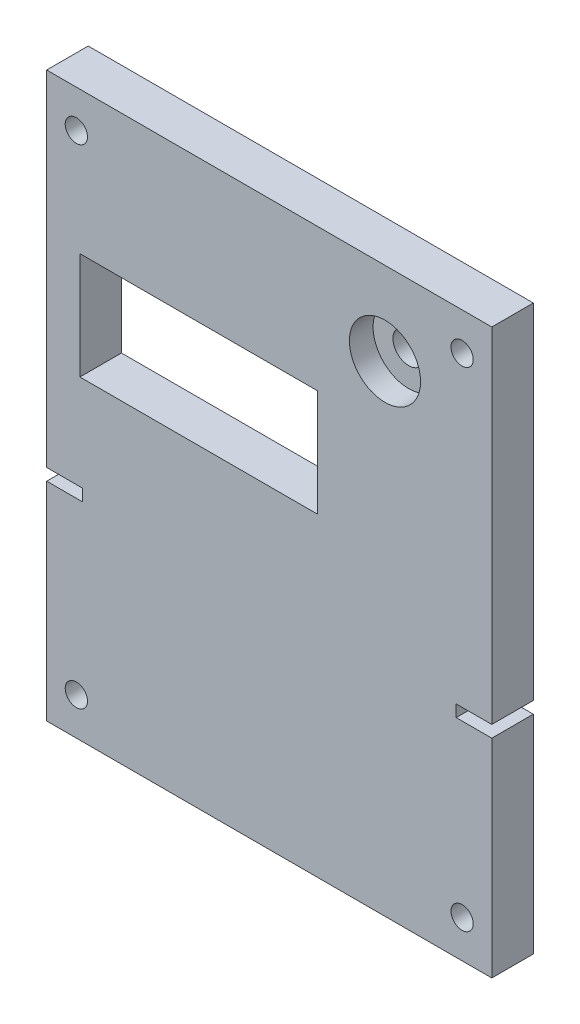
ISO-10303-21;
HEADER;
FILE_DESCRIPTION(('STEP AP214'),'2;1');
FILE_NAME('part.step','',(''),(''),'','','');
FILE_SCHEMA(('AUTOMOTIVE_DESIGN { 1 0 10303 214 1 1 1 1 }'));
ENDSEC;
DATA;
#1=APPLICATION_CONTEXT('core data for automotive mechanical design processes');
#2=APPLICATION_PROTOCOL_DEFINITION('international standard','automotive_design',2000,#1);
#3=PRODUCT_CONTEXT('',#1,'mechanical');
#4=PRODUCT('Part','Part','',(#3));
#5=PRODUCT_RELATED_PRODUCT_CATEGORY('part','',(#4));
#6=PRODUCT_DEFINITION_FORMATION('','',#4);
#7=PRODUCT_DEFINITION_CONTEXT('part definition',#1,'design');
#8=PRODUCT_DEFINITION('design','',#6,#7);
#9=PRODUCT_DEFINITION_SHAPE('','',#8);
#10=(LENGTH_UNIT() NAMED_UNIT(*) SI_UNIT(.MILLI.,.METRE.));
#11=(NAMED_UNIT(*) PLANE_ANGLE_UNIT() SI_UNIT($,.RADIAN.));
#12=(NAMED_UNIT(*) SI_UNIT($,.STERADIAN.) SOLID_ANGLE_UNIT());
#13=UNCERTAINTY_MEASURE_WITH_UNIT(LENGTH_MEASURE(1.E-05),#10,'distance_accuracy_value','');
#14=(GEOMETRIC_REPRESENTATION_CONTEXT(3) GLOBAL_UNCERTAINTY_ASSIGNED_CONTEXT((#13)) GLOBAL_UNIT_ASSIGNED_CONTEXT((#10,
#11,#12)) REPRESENTATION_CONTEXT('',''));
#15=CARTESIAN_POINT('',(0.,0.,0.));
#16=DIRECTION('',(0.,0.,1.));
#17=DIRECTION('',(1.,0.,0.));
#18=AXIS2_PLACEMENT_3D('',#15,#16,#17);
#19=CARTESIAN_POINT('',(47.625,-60.325,8.89));
#20=DIRECTION('',(-1.,0.,0.));
#21=DIRECTION('',(0.,0.,1.));
#22=AXIS2_PLACEMENT_3D('',#19,#20,#21);
#23=PLANE('',#22);
#24=DIRECTION('',(0.,1.,0.));
#25=VECTOR('',#24,1.);
#26=CARTESIAN_POINT('',(47.625,-60.325,0.));
#27=LINE('',#26,#25);
#28=CARTESIAN_POINT('',(47.625,-60.325,0.));
#29=VERTEX_POINT('',#28);
#30=CARTESIAN_POINT('',(47.625,-15.875,0.));
#31=VERTEX_POINT('',#30);
#32=EDGE_CURVE('E188',#29,#31,#27,.T.);
#33=ORIENTED_EDGE('',*,*,#32,.T.);
#34=DIRECTION('',(0.,0.,1.));
#35=VECTOR('',#34,1.);
#36=CARTESIAN_POINT('',(47.625,-15.875,0.));
#37=LINE('',#36,#35);
#38=CARTESIAN_POINT('',(47.625,-15.875,8.89));
#39=VERTEX_POINT('',#38);
#40=EDGE_CURVE('E227',#31,#39,#37,.T.);
#41=ORIENTED_EDGE('',*,*,#40,.T.);
#42=DIRECTION('',(0.,1.,0.));
#43=VECTOR('',#42,1.);
#44=CARTESIAN_POINT('',(47.625,-60.325,8.89));
#45=LINE('',#44,#43);
#46=CARTESIAN_POINT('',(47.625,-60.325,8.89));
#47=VERTEX_POINT('',#46);
#48=EDGE_CURVE('E367',#47,#39,#45,.T.);
#49=ORIENTED_EDGE('',*,*,#48,.F.);
#50=DIRECTION('',(0.,0.,-1.));
#51=VECTOR('',#50,1.);
#52=CARTESIAN_POINT('',(47.625,-60.325,8.89));
#53=LINE('',#52,#51);
#54=EDGE_CURVE('E195',#47,#29,#53,.T.);
#55=ORIENTED_EDGE('',*,*,#54,.T.);
#56=EDGE_LOOP('',(#33,#41,#49,#55));
#57=FACE_BOUND('',#56,.T.);
#58=ADVANCED_FACE('F40',(#57),#23,.F.);
#59=CARTESIAN_POINT('',(-47.625,-60.325,8.89));
#60=DIRECTION('',(1.,0.,0.));
#61=DIRECTION('',(0.,0.,-1.));
#62=AXIS2_PLACEMENT_3D('',#59,#60,#61);
#63=PLANE('',#62);
#64=DIRECTION('',(0.,-1.,0.));
#65=VECTOR('',#64,1.);
#66=CARTESIAN_POINT('',(-47.625,-60.325,0.));
#67=LINE('',#66,#65);
#68=CARTESIAN_POINT('',(-47.625,60.325,0.));
#69=VERTEX_POINT('',#68);
#70=CARTESIAN_POINT('',(-47.625,-13.335,0.));
#71=VERTEX_POINT('',#70);
#72=EDGE_CURVE('E182',#69,#71,#67,.T.);
#73=ORIENTED_EDGE('',*,*,#72,.T.);
#74=DIRECTION('',(0.,0.,1.));
#75=VECTOR('',#74,1.);
#76=CARTESIAN_POINT('',(-47.625,-13.335,0.));
#77=LINE('',#76,#75);
#78=CARTESIAN_POINT('',(-47.625,-13.335,8.89));
#79=VERTEX_POINT('',#78);
#80=EDGE_CURVE('E233',#71,#79,#77,.T.);
#81=ORIENTED_EDGE('',*,*,#80,.T.);
#82=DIRECTION('',(0.,-1.,0.));
#83=VECTOR('',#82,1.);
#84=CARTESIAN_POINT('',(-47.625,-60.325,8.89));
#85=LINE('',#84,#83);
#86=CARTESIAN_POINT('',(-47.625,60.325,8.89));
#87=VERTEX_POINT('',#86);
#88=EDGE_CURVE('E211',#87,#79,#85,.T.);
#89=ORIENTED_EDGE('',*,*,#88,.F.);
#90=DIRECTION('',(0.,0.,-1.));
#91=VECTOR('',#90,1.);
#92=CARTESIAN_POINT('',(-47.625,60.325,8.89));
#93=LINE('',#92,#91);
#94=EDGE_CURVE('E49',#87,#69,#93,.T.);
#95=ORIENTED_EDGE('',*,*,#94,.T.);
#96=EDGE_LOOP('',(#73,#81,#89,#95));
#97=FACE_BOUND('',#96,.T.);
#98=ADVANCED_FACE('F208',(#97),#63,.F.);
#99=CARTESIAN_POINT('',(47.625,-13.335,8.89));
#100=VERTEX_POINT('',#99);
#101=CARTESIAN_POINT('',(47.625,60.325,8.89));
#102=VERTEX_POINT('',#101);
#103=EDGE_CURVE('E194',#100,#102,#45,.T.);
#104=ORIENTED_EDGE('',*,*,#103,.F.);
#105=DIRECTION('',(0.,0.,1.));
#106=VECTOR('',#105,1.);
#107=CARTESIAN_POINT('',(47.625,-13.335,0.));
#108=LINE('',#107,#106);
#109=CARTESIAN_POINT('',(47.625,-13.335,0.));
#110=VERTEX_POINT('',#109);
#111=EDGE_CURVE('E253',#110,#100,#108,.T.);
#112=ORIENTED_EDGE('',*,*,#111,.F.);
#113=CARTESIAN_POINT('',(47.625,60.325,0.));
#114=VERTEX_POINT('',#113);
#115=EDGE_CURVE('E363',#110,#114,#27,.T.);
#116=ORIENTED_EDGE('',*,*,#115,.T.);
#117=DIRECTION('',(0.,0.,-1.));
#118=VECTOR('',#117,1.);
#119=CARTESIAN_POINT('',(47.625,60.325,8.89));
#120=LINE('',#119,#118);
#121=EDGE_CURVE('E12',#102,#114,#120,.T.);
#122=ORIENTED_EDGE('',*,*,#121,.F.);
#123=EDGE_LOOP('',(#104,#112,#116,#122));
#124=FACE_BOUND('',#123,.T.);
#125=ADVANCED_FACE('F42',(#124),#23,.F.);
#126=CARTESIAN_POINT('',(-47.625,60.325,8.89));
#127=DIRECTION('',(0.,-1.,0.));
#128=DIRECTION('',(0.,0.,-1.));
#129=AXIS2_PLACEMENT_3D('',#126,#127,#128);
#130=PLANE('',#129);
#131=DIRECTION('',(-1.,0.,0.));
#132=VECTOR('',#131,1.);
#133=CARTESIAN_POINT('',(-47.625,60.325,0.));
#134=LINE('',#133,#132);
#135=EDGE_CURVE('E183',#114,#69,#134,.T.);
#136=ORIENTED_EDGE('',*,*,#135,.T.);
#137=ORIENTED_EDGE('',*,*,#94,.F.);
#138=DIRECTION('',(-1.,0.,0.));
#139=VECTOR('',#138,1.);
#140=CARTESIAN_POINT('',(-47.625,60.325,8.89));
#141=LINE('',#140,#139);
#142=EDGE_CURVE('E371',#102,#87,#141,.T.);
#143=ORIENTED_EDGE('',*,*,#142,.F.);
#144=ORIENTED_EDGE('',*,*,#121,.T.);
#145=EDGE_LOOP('',(#136,#137,#143,#144));
#146=FACE_BOUND('',#145,.T.);
#147=ADVANCED_FACE('F404',(#146),#130,.F.);
#148=CARTESIAN_POINT('',(-47.625,-15.875,8.89));
#149=VERTEX_POINT('',#148);
#150=CARTESIAN_POINT('',(-47.625,-60.325,8.89));
#151=VERTEX_POINT('',#150);
#152=EDGE_CURVE('E171',#149,#151,#85,.T.);
#153=ORIENTED_EDGE('',*,*,#152,.F.);
#154=DIRECTION('',(0.,0.,1.));
#155=VECTOR('',#154,1.);
#156=CARTESIAN_POINT('',(-47.625,-15.875,0.));
#157=LINE('',#156,#155);
#158=CARTESIAN_POINT('',(-47.625,-15.875,0.));
#159=VERTEX_POINT('',#158);
#160=EDGE_CURVE('E157',#159,#149,#157,.T.);
#161=ORIENTED_EDGE('',*,*,#160,.F.);
#162=CARTESIAN_POINT('',(-47.625,-60.325,0.));
#163=VERTEX_POINT('',#162);
#164=EDGE_CURVE('E169',#159,#163,#67,.T.);
#165=ORIENTED_EDGE('',*,*,#164,.T.);
#166=DIRECTION('',(0.,0.,-1.));
#167=VECTOR('',#166,1.);
#168=CARTESIAN_POINT('',(-47.625,-60.325,8.89));
#169=LINE('',#168,#167);
#170=EDGE_CURVE('E199',#151,#163,#169,.T.);
#171=ORIENTED_EDGE('',*,*,#170,.F.);
#172=EDGE_LOOP('',(#153,#161,#165,#171));
#173=FACE_BOUND('',#172,.T.);
#174=ADVANCED_FACE('F167',(#173),#63,.F.);
#175=CARTESIAN_POINT('',(-47.625,-60.325,8.89));
#176=DIRECTION('',(0.,1.,0.));
#177=DIRECTION('',(0.,0.,1.));
#178=AXIS2_PLACEMENT_3D('',#175,#176,#177);
#179=PLANE('',#178);
#180=DIRECTION('',(1.,0.,0.));
#181=VECTOR('',#180,1.);
#182=CARTESIAN_POINT('',(-47.625,-60.325,0.));
#183=LINE('',#182,#181);
#184=EDGE_CURVE('E180',#163,#29,#183,.T.);
#185=ORIENTED_EDGE('',*,*,#184,.T.);
#186=ORIENTED_EDGE('',*,*,#54,.F.);
#187=DIRECTION('',(1.,0.,0.));
#188=VECTOR('',#187,1.);
#189=CARTESIAN_POINT('',(-47.625,-60.325,8.89));
#190=LINE('',#189,#188);
#191=EDGE_CURVE('E200',#151,#47,#190,.T.);
#192=ORIENTED_EDGE('',*,*,#191,.F.);
#193=ORIENTED_EDGE('',*,*,#170,.T.);
#194=EDGE_LOOP('',(#185,#186,#192,#193));
#195=FACE_BOUND('',#194,.T.);
#196=ADVANCED_FACE('F400',(#195),#179,.F.);
#197=CARTESIAN_POINT('',(0.,0.,8.89));
#198=DIRECTION('',(0.,0.,-1.));
#199=DIRECTION('',(-1.,0.,0.));
#200=AXIS2_PLACEMENT_3D('',#197,#198,#199);
#201=PLANE('',#200);
#202=DIRECTION('',(-1.,0.,0.));
#203=VECTOR('',#202,1.);
#204=CARTESIAN_POINT('',(-40.513,29.845,8.89));
#205=LINE('',#204,#203);
#206=CARTESIAN_POINT('',(10.287,29.845,8.89));
#207=VERTEX_POINT('',#206);
#208=CARTESIAN_POINT('',(-40.513,29.845,8.89));
#209=VERTEX_POINT('',#208);
#210=EDGE_CURVE('E295',#207,#209,#205,.T.);
#211=ORIENTED_EDGE('',*,*,#210,.F.);
#212=DIRECTION('',(0.,1.,0.));
#213=VECTOR('',#212,1.);
#214=CARTESIAN_POINT('',(10.287,29.845,8.89));
#215=LINE('',#214,#213);
#216=CARTESIAN_POINT('',(10.287,6.98499999999999,8.89));
#217=VERTEX_POINT('',#216);
#218=EDGE_CURVE('E236',#217,#207,#215,.T.);
#219=ORIENTED_EDGE('',*,*,#218,.F.);
#220=DIRECTION('',(1.,0.,0.));
#221=VECTOR('',#220,1.);
#222=CARTESIAN_POINT('',(-40.513,6.98499999999999,8.89));
#223=LINE('',#222,#221);
#224=CARTESIAN_POINT('',(-40.513,6.98499999999999,8.89));
#225=VERTEX_POINT('',#224);
#226=EDGE_CURVE('E280',#225,#217,#223,.T.);
#227=ORIENTED_EDGE('',*,*,#226,.F.);
#228=DIRECTION('',(0.,-1.,0.));
#229=VECTOR('',#228,1.);
#230=CARTESIAN_POINT('',(-40.513,29.845,8.89));
#231=LINE('',#230,#229);
#232=EDGE_CURVE('E299',#209,#225,#231,.T.);
#233=ORIENTED_EDGE('',*,*,#232,.F.);
#234=EDGE_LOOP('',(#211,#219,#227,#233));
#235=FACE_BOUND('',#234,.T.);
#236=CARTESIAN_POINT('',(24.765,42.545,8.89));
#237=DIRECTION('',(0.,0.,1.));
#238=DIRECTION('',(1.,0.,0.));
#239=AXIS2_PLACEMENT_3D('',#236,#237,#238);
#240=CIRCLE('',#239,7.62);
#241=CARTESIAN_POINT('',(32.385,42.545,8.89));
#242=VERTEX_POINT('',#241);
#243=EDGE_CURVE('E323',#242,#242,#240,.T.);
#244=ORIENTED_EDGE('',*,*,#243,.F.);
#245=EDGE_LOOP('',(#244));
#246=FACE_BOUND('',#245,.T.);
#247=CARTESIAN_POINT('',(41.275,-52.2816666666667,8.89));
#248=DIRECTION('',(0.,0.,1.));
#249=DIRECTION('',(1.,0.,0.));
#250=AXIS2_PLACEMENT_3D('',#247,#248,#249);
#251=CIRCLE('',#250,2.38125);
#252=CARTESIAN_POINT('',(43.65625,-52.2816666666667,8.89));
#253=VERTEX_POINT('',#252);
#254=EDGE_CURVE('E348',#253,#253,#251,.T.);
#255=ORIENTED_EDGE('',*,*,#254,.F.);
#256=EDGE_LOOP('',(#255));
#257=FACE_BOUND('',#256,.T.);
#258=CARTESIAN_POINT('',(-41.275,-52.2816666666667,8.89));
#259=DIRECTION('',(0.,0.,1.));
#260=DIRECTION('',(1.,0.,0.));
#261=AXIS2_PLACEMENT_3D('',#258,#259,#260);
#262=CIRCLE('',#261,2.38125);
#263=CARTESIAN_POINT('',(-38.89375,-52.2816666666667,8.89));
#264=VERTEX_POINT('',#263);
#265=EDGE_CURVE('E339',#264,#264,#262,.T.);
#266=ORIENTED_EDGE('',*,*,#265,.F.);
#267=EDGE_LOOP('',(#266));
#268=FACE_BOUND('',#267,.T.);
#269=CARTESIAN_POINT('',(-41.2749999999999,52.2816666666666,8.89));
#270=DIRECTION('',(0.,0.,1.));
#271=DIRECTION('',(1.,0.,0.));
#272=AXIS2_PLACEMENT_3D('',#269,#270,#271);
#273=CIRCLE('',#272,2.38125);
#274=CARTESIAN_POINT('',(-38.8937499999999,52.2816666666666,8.89));
#275=VERTEX_POINT('',#274);
#276=EDGE_CURVE('E331',#275,#275,#273,.T.);
#277=ORIENTED_EDGE('',*,*,#276,.F.);
#278=EDGE_LOOP('',(#277));
#279=FACE_BOUND('',#278,.T.);
#280=CARTESIAN_POINT('',(41.275,52.2816666666666,8.89));
#281=DIRECTION('',(0.,0.,1.));
#282=DIRECTION('',(1.,0.,0.));
#283=AXIS2_PLACEMENT_3D('',#280,#281,#282);
#284=CIRCLE('',#283,2.38125);
#285=CARTESIAN_POINT('',(43.65625,52.2816666666666,8.89));
#286=VERTEX_POINT('',#285);
#287=EDGE_CURVE('E347',#286,#286,#284,.T.);
#288=ORIENTED_EDGE('',*,*,#287,.F.);
#289=EDGE_LOOP('',(#288));
#290=FACE_BOUND('',#289,.T.);
#291=ORIENTED_EDGE('',*,*,#88,.T.);
#292=DIRECTION('',(-1.,0.,0.));
#293=VECTOR('',#292,1.);
#294=CARTESIAN_POINT('',(-47.625,-13.335,8.89));
#295=LINE('',#294,#293);
#296=CARTESIAN_POINT('',(-40.005,-13.335,8.89));
#297=VERTEX_POINT('',#296);
#298=EDGE_CURVE('E163',#297,#79,#295,.T.);
#299=ORIENTED_EDGE('',*,*,#298,.F.);
#300=DIRECTION('',(0.,1.,0.));
#301=VECTOR('',#300,1.);
#302=CARTESIAN_POINT('',(-40.005,-13.335,8.89));
#303=LINE('',#302,#301);
#304=CARTESIAN_POINT('',(-40.005,-15.875,8.89));
#305=VERTEX_POINT('',#304);
#306=EDGE_CURVE('E226',#305,#297,#303,.T.);
#307=ORIENTED_EDGE('',*,*,#306,.F.);
#308=DIRECTION('',(1.,0.,0.));
#309=VECTOR('',#308,1.);
#310=CARTESIAN_POINT('',(-40.005,-15.875,8.89));
#311=LINE('',#310,#309);
#312=EDGE_CURVE('E223',#149,#305,#311,.T.);
#313=ORIENTED_EDGE('',*,*,#312,.F.);
#314=ORIENTED_EDGE('',*,*,#152,.T.);
#315=ORIENTED_EDGE('',*,*,#191,.T.);
#316=ORIENTED_EDGE('',*,*,#48,.T.);
#317=DIRECTION('',(1.,0.,0.));
#318=VECTOR('',#317,1.);
#319=CARTESIAN_POINT('',(40.005,-15.875,8.89));
#320=LINE('',#319,#318);
#321=CARTESIAN_POINT('',(40.005,-15.875,8.89));
#322=VERTEX_POINT('',#321);
#323=EDGE_CURVE('E246',#322,#39,#320,.T.);
#324=ORIENTED_EDGE('',*,*,#323,.F.);
#325=DIRECTION('',(0.,-1.,0.));
#326=VECTOR('',#325,1.);
#327=CARTESIAN_POINT('',(40.005,-13.335,8.89));
#328=LINE('',#327,#326);
#329=CARTESIAN_POINT('',(40.005,-13.335,8.89));
#330=VERTEX_POINT('',#329);
#331=EDGE_CURVE('E258',#330,#322,#328,.T.);
#332=ORIENTED_EDGE('',*,*,#331,.F.);
#333=DIRECTION('',(-1.,0.,0.));
#334=VECTOR('',#333,1.);
#335=CARTESIAN_POINT('',(47.625,-13.335,8.89));
#336=LINE('',#335,#334);
#337=EDGE_CURVE('E254',#100,#330,#336,.T.);
#338=ORIENTED_EDGE('',*,*,#337,.F.);
#339=ORIENTED_EDGE('',*,*,#103,.T.);
#340=ORIENTED_EDGE('',*,*,#142,.T.);
#341=EDGE_LOOP('',(#291,#299,#307,#313,#314,#315,#316,#324,#332,#338,#339,#340));
#342=FACE_BOUND('',#341,.T.);
#343=ADVANCED_FACE('F393',(#235,#246,#257,#268,#279,#290,#342),#201,.F.);
#344=CARTESIAN_POINT('',(0.,0.,0.));
#345=DIRECTION('',(0.,0.,-1.));
#346=DIRECTION('',(-1.,0.,0.));
#347=AXIS2_PLACEMENT_3D('',#344,#345,#346);
#348=PLANE('',#347);
#349=DIRECTION('',(-1.,0.,0.));
#350=VECTOR('',#349,1.);
#351=CARTESIAN_POINT('',(-47.625,-13.335,0.));
#352=LINE('',#351,#350);
#353=CARTESIAN_POINT('',(-40.005,-13.335,0.));
#354=VERTEX_POINT('',#353);
#355=EDGE_CURVE('E173',#354,#71,#352,.T.);
#356=ORIENTED_EDGE('',*,*,#355,.T.);
#357=ORIENTED_EDGE('',*,*,#72,.F.);
#358=ORIENTED_EDGE('',*,*,#135,.F.);
#359=ORIENTED_EDGE('',*,*,#115,.F.);
#360=DIRECTION('',(-1.,0.,0.));
#361=VECTOR('',#360,1.);
#362=CARTESIAN_POINT('',(47.625,-13.335,0.));
#363=LINE('',#362,#361);
#364=CARTESIAN_POINT('',(40.005,-13.335,0.));
#365=VERTEX_POINT('',#364);
#366=EDGE_CURVE('E242',#110,#365,#363,.T.);
#367=ORIENTED_EDGE('',*,*,#366,.T.);
#368=DIRECTION('',(0.,-1.,0.));
#369=VECTOR('',#368,1.);
#370=CARTESIAN_POINT('',(40.005,-13.335,0.));
#371=LINE('',#370,#369);
#372=CARTESIAN_POINT('',(40.005,-15.875,0.));
#373=VERTEX_POINT('',#372);
#374=EDGE_CURVE('E64',#365,#373,#371,.T.);
#375=ORIENTED_EDGE('',*,*,#374,.T.);
#376=DIRECTION('',(1.,0.,0.));
#377=VECTOR('',#376,1.);
#378=CARTESIAN_POINT('',(40.005,-15.875,0.));
#379=LINE('',#378,#377);
#380=EDGE_CURVE('E249',#373,#31,#379,.T.);
#381=ORIENTED_EDGE('',*,*,#380,.T.);
#382=ORIENTED_EDGE('',*,*,#32,.F.);
#383=ORIENTED_EDGE('',*,*,#184,.F.);
#384=ORIENTED_EDGE('',*,*,#164,.F.);
#385=DIRECTION('',(1.,0.,0.));
#386=VECTOR('',#385,1.);
#387=CARTESIAN_POINT('',(-40.005,-15.875,0.));
#388=LINE('',#387,#386);
#389=CARTESIAN_POINT('',(-40.005,-15.875,0.));
#390=VERTEX_POINT('',#389);
#391=EDGE_CURVE('E153',#159,#390,#388,.T.);
#392=ORIENTED_EDGE('',*,*,#391,.T.);
#393=DIRECTION('',(0.,1.,0.));
#394=VECTOR('',#393,1.);
#395=CARTESIAN_POINT('',(-40.005,-13.335,0.));
#396=LINE('',#395,#394);
#397=EDGE_CURVE('E56',#390,#354,#396,.T.);
#398=ORIENTED_EDGE('',*,*,#397,.T.);
#399=EDGE_LOOP('',(#356,#357,#358,#359,#367,#375,#381,#382,#383,#384,#392,#398));
#400=FACE_BOUND('',#399,.T.);
#401=DIRECTION('',(0.,1.,0.));
#402=VECTOR('',#401,1.);
#403=CARTESIAN_POINT('',(10.287,29.845,0.));
#404=LINE('',#403,#402);
#405=CARTESIAN_POINT('',(10.287,6.98499999999999,0.));
#406=VERTEX_POINT('',#405);
#407=CARTESIAN_POINT('',(10.287,29.845,0.));
#408=VERTEX_POINT('',#407);
#409=EDGE_CURVE('E275',#406,#408,#404,.T.);
#410=ORIENTED_EDGE('',*,*,#409,.T.);
#411=DIRECTION('',(-1.,0.,0.));
#412=VECTOR('',#411,1.);
#413=CARTESIAN_POINT('',(-40.513,29.845,0.));
#414=LINE('',#413,#412);
#415=CARTESIAN_POINT('',(-40.513,29.845,0.));
#416=VERTEX_POINT('',#415);
#417=EDGE_CURVE('E279',#408,#416,#414,.T.);
#418=ORIENTED_EDGE('',*,*,#417,.T.);
#419=DIRECTION('',(0.,-1.,0.));
#420=VECTOR('',#419,1.);
#421=CARTESIAN_POINT('',(-40.513,29.845,0.));
#422=LINE('',#421,#420);
#423=CARTESIAN_POINT('',(-40.513,6.98499999999999,0.));
#424=VERTEX_POINT('',#423);
#425=EDGE_CURVE('E284',#416,#424,#422,.T.);
#426=ORIENTED_EDGE('',*,*,#425,.T.);
#427=DIRECTION('',(1.,0.,0.));
#428=VECTOR('',#427,1.);
#429=CARTESIAN_POINT('',(-40.513,6.98499999999999,0.));
#430=LINE('',#429,#428);
#431=EDGE_CURVE('E288',#424,#406,#430,.T.);
#432=ORIENTED_EDGE('',*,*,#431,.T.);
#433=EDGE_LOOP('',(#410,#418,#426,#432));
#434=FACE_BOUND('',#433,.T.);
#435=CARTESIAN_POINT('',(24.765,42.545,0.));
#436=DIRECTION('',(0.,0.,1.));
#437=DIRECTION('',(1.,0.,0.));
#438=AXIS2_PLACEMENT_3D('',#435,#436,#437);
#439=CIRCLE('',#438,3.3655);
#440=CARTESIAN_POINT('',(28.1305,42.545,0.));
#441=VERTEX_POINT('',#440);
#442=EDGE_CURVE('E319',#441,#441,#439,.T.);
#443=ORIENTED_EDGE('',*,*,#442,.T.);
#444=EDGE_LOOP('',(#443));
#445=FACE_BOUND('',#444,.T.);
#446=CARTESIAN_POINT('',(41.275,-52.2816666666667,0.));
#447=DIRECTION('',(0.,0.,1.));
#448=DIRECTION('',(1.,0.,0.));
#449=AXIS2_PLACEMENT_3D('',#446,#447,#448);
#450=CIRCLE('',#449,2.38125);
#451=CARTESIAN_POINT('',(43.65625,-52.2816666666667,0.));
#452=VERTEX_POINT('',#451);
#453=EDGE_CURVE('E343',#452,#452,#450,.T.);
#454=ORIENTED_EDGE('',*,*,#453,.T.);
#455=EDGE_LOOP('',(#454));
#456=FACE_BOUND('',#455,.T.);
#457=CARTESIAN_POINT('',(-41.275,-52.2816666666667,0.));
#458=DIRECTION('',(0.,0.,1.));
#459=DIRECTION('',(1.,0.,0.));
#460=AXIS2_PLACEMENT_3D('',#457,#458,#459);
#461=CIRCLE('',#460,2.38125);
#462=CARTESIAN_POINT('',(-38.89375,-52.2816666666667,0.));
#463=VERTEX_POINT('',#462);
#464=EDGE_CURVE('E352',#463,#463,#461,.T.);
#465=ORIENTED_EDGE('',*,*,#464,.T.);
#466=EDGE_LOOP('',(#465));
#467=FACE_BOUND('',#466,.T.);
#468=CARTESIAN_POINT('',(-41.2749999999999,52.2816666666666,0.));
#469=DIRECTION('',(0.,0.,1.));
#470=DIRECTION('',(1.,0.,0.));
#471=AXIS2_PLACEMENT_3D('',#468,#469,#470);
#472=CIRCLE('',#471,2.38125);
#473=CARTESIAN_POINT('',(-38.8937499999999,52.2816666666666,0.));
#474=VERTEX_POINT('',#473);
#475=EDGE_CURVE('E335',#474,#474,#472,.T.);
#476=ORIENTED_EDGE('',*,*,#475,.T.);
#477=EDGE_LOOP('',(#476));
#478=FACE_BOUND('',#477,.T.);
#479=CARTESIAN_POINT('',(41.275,52.2816666666666,0.));
#480=DIRECTION('',(0.,0.,1.));
#481=DIRECTION('',(1.,0.,0.));
#482=AXIS2_PLACEMENT_3D('',#479,#480,#481);
#483=CIRCLE('',#482,2.38125);
#484=CARTESIAN_POINT('',(43.65625,52.2816666666666,0.));
#485=VERTEX_POINT('',#484);
#486=EDGE_CURVE('E359',#485,#485,#483,.T.);
#487=ORIENTED_EDGE('',*,*,#486,.T.);
#488=EDGE_LOOP('',(#487));
#489=FACE_BOUND('',#488,.T.);
#490=ADVANCED_FACE('F177',(#400,#434,#445,#456,#467,#478,#489),#348,.T.);
#491=CARTESIAN_POINT('',(41.275,52.2816666666666,0.));
#492=DIRECTION('',(0.,0.,1.));
#493=DIRECTION('',(1.,0.,0.));
#494=AXIS2_PLACEMENT_3D('',#491,#492,#493);
#495=CYLINDRICAL_SURFACE('',#494,2.38125);
#496=ORIENTED_EDGE('',*,*,#486,.F.);
#497=EDGE_LOOP('',(#496));
#498=FACE_BOUND('',#497,.T.);
#499=ORIENTED_EDGE('',*,*,#287,.T.);
#500=EDGE_LOOP('',(#499));
#501=FACE_BOUND('',#500,.T.);
#502=ADVANCED_FACE('F422',(#498,#501),#495,.F.);
#503=CARTESIAN_POINT('',(-41.2749999999999,52.2816666666666,0.));
#504=DIRECTION('',(0.,0.,1.));
#505=DIRECTION('',(1.,0.,0.));
#506=AXIS2_PLACEMENT_3D('',#503,#504,#505);
#507=CYLINDRICAL_SURFACE('',#506,2.38125);
#508=ORIENTED_EDGE('',*,*,#475,.F.);
#509=EDGE_LOOP('',(#508));
#510=FACE_BOUND('',#509,.T.);
#511=ORIENTED_EDGE('',*,*,#276,.T.);
#512=EDGE_LOOP('',(#511));
#513=FACE_BOUND('',#512,.T.);
#514=ADVANCED_FACE('F428',(#510,#513),#507,.F.);
#515=CARTESIAN_POINT('',(-41.275,-52.2816666666667,0.));
#516=DIRECTION('',(0.,0.,1.));
#517=DIRECTION('',(1.,0.,0.));
#518=AXIS2_PLACEMENT_3D('',#515,#516,#517);
#519=CYLINDRICAL_SURFACE('',#518,2.38125);
#520=ORIENTED_EDGE('',*,*,#464,.F.);
#521=EDGE_LOOP('',(#520));
#522=FACE_BOUND('',#521,.T.);
#523=ORIENTED_EDGE('',*,*,#265,.T.);
#524=EDGE_LOOP('',(#523));
#525=FACE_BOUND('',#524,.T.);
#526=ADVANCED_FACE('F430',(#522,#525),#519,.F.);
#527=CARTESIAN_POINT('',(41.275,-52.2816666666667,0.));
#528=DIRECTION('',(0.,0.,1.));
#529=DIRECTION('',(1.,0.,0.));
#530=AXIS2_PLACEMENT_3D('',#527,#528,#529);
#531=CYLINDRICAL_SURFACE('',#530,2.38125);
#532=ORIENTED_EDGE('',*,*,#453,.F.);
#533=EDGE_LOOP('',(#532));
#534=FACE_BOUND('',#533,.T.);
#535=ORIENTED_EDGE('',*,*,#254,.T.);
#536=EDGE_LOOP('',(#535));
#537=FACE_BOUND('',#536,.T.);
#538=ADVANCED_FACE('F433',(#534,#537),#531,.F.);
#539=CARTESIAN_POINT('',(24.765,42.545,3.81));
#540=DIRECTION('',(0.,0.,1.));
#541=DIRECTION('',(1.,0.,0.));
#542=AXIS2_PLACEMENT_3D('',#539,#540,#541);
#543=CYLINDRICAL_SURFACE('',#542,7.62);
#544=CARTESIAN_POINT('',(24.765,42.545,3.81));
#545=DIRECTION('',(0.,0.,1.));
#546=DIRECTION('',(1.,0.,0.));
#547=AXIS2_PLACEMENT_3D('',#544,#545,#546);
#548=CIRCLE('',#547,7.62);
#549=CARTESIAN_POINT('',(32.385,42.545,3.81));
#550=VERTEX_POINT('',#549);
#551=EDGE_CURVE('E327',#550,#550,#548,.T.);
#552=ORIENTED_EDGE('',*,*,#551,.F.);
#553=EDGE_LOOP('',(#552));
#554=FACE_BOUND('',#553,.T.);
#555=ORIENTED_EDGE('',*,*,#243,.T.);
#556=EDGE_LOOP('',(#555));
#557=FACE_BOUND('',#556,.T.);
#558=ADVANCED_FACE('F437',(#554,#557),#543,.F.);
#559=CARTESIAN_POINT('',(24.765,42.545,3.81));
#560=DIRECTION('',(0.,0.,1.));
#561=DIRECTION('',(1.,0.,0.));
#562=AXIS2_PLACEMENT_3D('',#559,#560,#561);
#563=PLANE('',#562);
#564=CARTESIAN_POINT('',(24.765,42.545,3.81));
#565=DIRECTION('',(0.,0.,1.));
#566=DIRECTION('',(1.,0.,0.));
#567=AXIS2_PLACEMENT_3D('',#564,#565,#566);
#568=CIRCLE('',#567,3.3655);
#569=CARTESIAN_POINT('',(28.1305,42.545,3.81));
#570=VERTEX_POINT('',#569);
#571=EDGE_CURVE('E309',#570,#570,#568,.T.);
#572=ORIENTED_EDGE('',*,*,#571,.F.);
#573=EDGE_LOOP('',(#572));
#574=FACE_BOUND('',#573,.T.);
#575=ORIENTED_EDGE('',*,*,#551,.T.);
#576=EDGE_LOOP('',(#575));
#577=FACE_BOUND('',#576,.T.);
#578=ADVANCED_FACE('F444',(#574,#577),#563,.T.);
#579=CARTESIAN_POINT('',(24.765,42.545,0.));
#580=DIRECTION('',(0.,0.,1.));
#581=DIRECTION('',(1.,0.,0.));
#582=AXIS2_PLACEMENT_3D('',#579,#580,#581);
#583=CYLINDRICAL_SURFACE('',#582,3.3655);
#584=ORIENTED_EDGE('',*,*,#442,.F.);
#585=EDGE_LOOP('',(#584));
#586=FACE_BOUND('',#585,.T.);
#587=ORIENTED_EDGE('',*,*,#571,.T.);
#588=EDGE_LOOP('',(#587));
#589=FACE_BOUND('',#588,.T.);
#590=ADVANCED_FACE('F448',(#586,#589),#583,.F.);
#591=CARTESIAN_POINT('',(10.287,29.845,0.));
#592=DIRECTION('',(1.,0.,0.));
#593=DIRECTION('',(0.,1.,0.));
#594=AXIS2_PLACEMENT_3D('',#591,#592,#593);
#595=PLANE('',#594);
#596=ORIENTED_EDGE('',*,*,#218,.T.);
#597=DIRECTION('',(0.,0.,1.));
#598=VECTOR('',#597,1.);
#599=CARTESIAN_POINT('',(10.287,29.845,0.));
#600=LINE('',#599,#598);
#601=EDGE_CURVE('E292',#408,#207,#600,.T.);
#602=ORIENTED_EDGE('',*,*,#601,.F.);
#603=ORIENTED_EDGE('',*,*,#409,.F.);
#604=DIRECTION('',(0.,0.,1.));
#605=VECTOR('',#604,1.);
#606=CARTESIAN_POINT('',(10.287,6.98499999999999,0.));
#607=LINE('',#606,#605);
#608=EDGE_CURVE('E306',#406,#217,#607,.T.);
#609=ORIENTED_EDGE('',*,*,#608,.T.);
#610=EDGE_LOOP('',(#596,#602,#603,#609));
#611=FACE_BOUND('',#610,.T.);
#612=ADVANCED_FACE('F452',(#611),#595,.F.);
#613=CARTESIAN_POINT('',(-40.513,6.98499999999999,0.));
#614=DIRECTION('',(0.,-1.,0.));
#615=DIRECTION('',(0.,0.,-1.));
#616=AXIS2_PLACEMENT_3D('',#613,#614,#615);
#617=PLANE('',#616);
#618=ORIENTED_EDGE('',*,*,#226,.T.);
#619=ORIENTED_EDGE('',*,*,#608,.F.);
#620=ORIENTED_EDGE('',*,*,#431,.F.);
#621=DIRECTION('',(0.,0.,1.));
#622=VECTOR('',#621,1.);
#623=CARTESIAN_POINT('',(-40.513,6.98499999999999,0.));
#624=LINE('',#623,#622);
#625=EDGE_CURVE('E310',#424,#225,#624,.T.);
#626=ORIENTED_EDGE('',*,*,#625,.T.);
#627=EDGE_LOOP('',(#618,#619,#620,#626));
#628=FACE_BOUND('',#627,.T.);
#629=ADVANCED_FACE('F456',(#628),#617,.F.);
#630=CARTESIAN_POINT('',(-40.513,29.845,0.));
#631=DIRECTION('',(-1.,0.,0.));
#632=DIRECTION('',(0.,0.,1.));
#633=AXIS2_PLACEMENT_3D('',#630,#631,#632);
#634=PLANE('',#633);
#635=ORIENTED_EDGE('',*,*,#232,.T.);
#636=ORIENTED_EDGE('',*,*,#625,.F.);
#637=ORIENTED_EDGE('',*,*,#425,.F.);
#638=DIRECTION('',(0.,0.,1.));
#639=VECTOR('',#638,1.);
#640=CARTESIAN_POINT('',(-40.513,29.845,0.));
#641=LINE('',#640,#639);
#642=EDGE_CURVE('E313',#416,#209,#641,.T.);
#643=ORIENTED_EDGE('',*,*,#642,.T.);
#644=EDGE_LOOP('',(#635,#636,#637,#643));
#645=FACE_BOUND('',#644,.T.);
#646=ADVANCED_FACE('F461',(#645),#634,.F.);
#647=CARTESIAN_POINT('',(-40.513,29.845,0.));
#648=DIRECTION('',(0.,1.,0.));
#649=DIRECTION('',(0.,0.,1.));
#650=AXIS2_PLACEMENT_3D('',#647,#648,#649);
#651=PLANE('',#650);
#652=ORIENTED_EDGE('',*,*,#210,.T.);
#653=ORIENTED_EDGE('',*,*,#642,.F.);
#654=ORIENTED_EDGE('',*,*,#417,.F.);
#655=ORIENTED_EDGE('',*,*,#601,.T.);
#656=EDGE_LOOP('',(#652,#653,#654,#655));
#657=FACE_BOUND('',#656,.T.);
#658=ADVANCED_FACE('F458',(#657),#651,.F.);
#659=CARTESIAN_POINT('',(40.005,-15.875,0.));
#660=DIRECTION('',(0.,-1.,0.));
#661=DIRECTION('',(1.,0.,0.));
#662=AXIS2_PLACEMENT_3D('',#659,#660,#661);
#663=PLANE('',#662);
#664=ORIENTED_EDGE('',*,*,#323,.T.);
#665=ORIENTED_EDGE('',*,*,#40,.F.);
#666=ORIENTED_EDGE('',*,*,#380,.F.);
#667=DIRECTION('',(0.,0.,1.));
#668=VECTOR('',#667,1.);
#669=CARTESIAN_POINT('',(40.005,-15.875,0.));
#670=LINE('',#669,#668);
#671=EDGE_CURVE('E267',#373,#322,#670,.T.);
#672=ORIENTED_EDGE('',*,*,#671,.T.);
#673=EDGE_LOOP('',(#664,#665,#666,#672));
#674=FACE_BOUND('',#673,.T.);
#675=ADVANCED_FACE('F396',(#674),#663,.F.);
#676=CARTESIAN_POINT('',(40.005,-13.335,0.));
#677=DIRECTION('',(-1.,0.,0.));
#678=DIRECTION('',(0.,0.,1.));
#679=AXIS2_PLACEMENT_3D('',#676,#677,#678);
#680=PLANE('',#679);
#681=ORIENTED_EDGE('',*,*,#331,.T.);
#682=ORIENTED_EDGE('',*,*,#671,.F.);
#683=ORIENTED_EDGE('',*,*,#374,.F.);
#684=DIRECTION('',(0.,0.,1.));
#685=VECTOR('',#684,1.);
#686=CARTESIAN_POINT('',(40.005,-13.335,0.));
#687=LINE('',#686,#685);
#688=EDGE_CURVE('E270',#365,#330,#687,.T.);
#689=ORIENTED_EDGE('',*,*,#688,.T.);
#690=EDGE_LOOP('',(#681,#682,#683,#689));
#691=FACE_BOUND('',#690,.T.);
#692=ADVANCED_FACE('F389',(#691),#680,.F.);
#693=CARTESIAN_POINT('',(47.625,-13.335,0.));
#694=DIRECTION('',(0.,1.,0.));
#695=DIRECTION('',(0.,0.,1.));
#696=AXIS2_PLACEMENT_3D('',#693,#694,#695);
#697=PLANE('',#696);
#698=ORIENTED_EDGE('',*,*,#337,.T.);
#699=ORIENTED_EDGE('',*,*,#688,.F.);
#700=ORIENTED_EDGE('',*,*,#366,.F.);
#701=ORIENTED_EDGE('',*,*,#111,.T.);
#702=EDGE_LOOP('',(#698,#699,#700,#701));
#703=FACE_BOUND('',#702,.T.);
#704=ADVANCED_FACE('F386',(#703),#697,.F.);
#705=CARTESIAN_POINT('',(-47.625,-13.335,0.));
#706=DIRECTION('',(0.,1.,0.));
#707=DIRECTION('',(-1.,0.,0.));
#708=AXIS2_PLACEMENT_3D('',#705,#706,#707);
#709=PLANE('',#708);
#710=ORIENTED_EDGE('',*,*,#298,.T.);
#711=ORIENTED_EDGE('',*,*,#80,.F.);
#712=ORIENTED_EDGE('',*,*,#355,.F.);
#713=DIRECTION('',(0.,0.,1.));
#714=VECTOR('',#713,1.);
#715=CARTESIAN_POINT('',(-40.005,-13.335,0.));
#716=LINE('',#715,#714);
#717=EDGE_CURVE('E237',#354,#297,#716,.T.);
#718=ORIENTED_EDGE('',*,*,#717,.T.);
#719=EDGE_LOOP('',(#710,#711,#712,#718));
#720=FACE_BOUND('',#719,.T.);
#721=ADVANCED_FACE('F471',(#720),#709,.F.);
#722=CARTESIAN_POINT('',(-40.005,-13.335,0.));
#723=DIRECTION('',(1.,0.,0.));
#724=DIRECTION('',(0.,0.,-1.));
#725=AXIS2_PLACEMENT_3D('',#722,#723,#724);
#726=PLANE('',#725);
#727=ORIENTED_EDGE('',*,*,#306,.T.);
#728=ORIENTED_EDGE('',*,*,#717,.F.);
#729=ORIENTED_EDGE('',*,*,#397,.F.);
#730=DIRECTION('',(0.,0.,1.));
#731=VECTOR('',#730,1.);
#732=CARTESIAN_POINT('',(-40.005,-15.875,0.));
#733=LINE('',#732,#731);
#734=EDGE_CURVE('E159',#390,#305,#733,.T.);
#735=ORIENTED_EDGE('',*,*,#734,.T.);
#736=EDGE_LOOP('',(#727,#728,#729,#735));
#737=FACE_BOUND('',#736,.T.);
#738=ADVANCED_FACE('F478',(#737),#726,.F.);
#739=CARTESIAN_POINT('',(-40.005,-15.875,0.));
#740=DIRECTION('',(0.,-1.,0.));
#741=DIRECTION('',(1.,0.,0.));
#742=AXIS2_PLACEMENT_3D('',#739,#740,#741);
#743=PLANE('',#742);
#744=ORIENTED_EDGE('',*,*,#312,.T.);
#745=ORIENTED_EDGE('',*,*,#734,.F.);
#746=ORIENTED_EDGE('',*,*,#391,.F.);
#747=ORIENTED_EDGE('',*,*,#160,.T.);
#748=EDGE_LOOP('',(#744,#745,#746,#747));
#749=FACE_BOUND('',#748,.T.);
#750=ADVANCED_FACE('F156',(#749),#743,.F.);
#751=CLOSED_SHELL('',(#58,#98,#125,#147,#174,#196,#343,#490,#502,#514,#526,#538,#558,#578,#590,
#612,#629,#646,#658,#675,#692,#704,#721,#738,#750));
#752=MANIFOLD_SOLID_BREP('B2',#751);
#753=ADVANCED_BREP_SHAPE_REPRESENTATION('',(#18,#752),#14);
#754=SHAPE_DEFINITION_REPRESENTATION(#9,#753);
ENDSEC;
END-ISO-10303-21;
